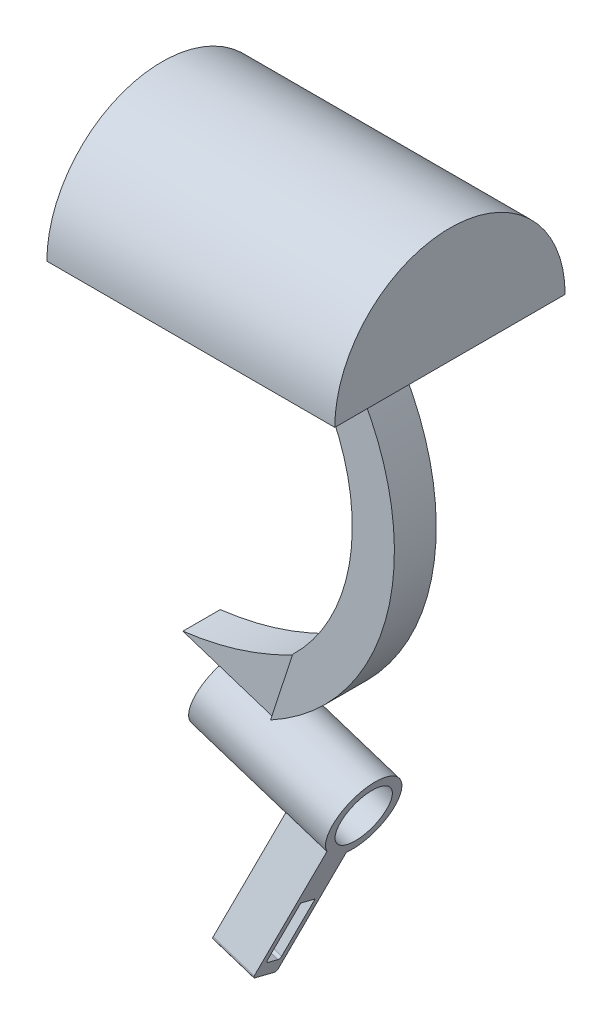
ISO-10303-21;
HEADER;
FILE_DESCRIPTION(('STEP AP214'),'2;1');
FILE_NAME('part.step','',(''),(''),'','','');
FILE_SCHEMA(('AUTOMOTIVE_DESIGN { 1 0 10303 214 1 1 1 1 }'));
ENDSEC;
DATA;
#1=APPLICATION_CONTEXT('core data for automotive mechanical design processes');
#2=APPLICATION_PROTOCOL_DEFINITION('international standard','automotive_design',2000,#1);
#3=PRODUCT_CONTEXT('',#1,'mechanical');
#4=PRODUCT('Part','Part','',(#3));
#5=PRODUCT_RELATED_PRODUCT_CATEGORY('part','',(#4));
#6=PRODUCT_DEFINITION_FORMATION('','',#4);
#7=PRODUCT_DEFINITION_CONTEXT('part definition',#1,'design');
#8=PRODUCT_DEFINITION('design','',#6,#7);
#9=PRODUCT_DEFINITION_SHAPE('','',#8);
#10=(LENGTH_UNIT() NAMED_UNIT(*) SI_UNIT(.MILLI.,.METRE.));
#11=(NAMED_UNIT(*) PLANE_ANGLE_UNIT() SI_UNIT($,.RADIAN.));
#12=(NAMED_UNIT(*) SI_UNIT($,.STERADIAN.) SOLID_ANGLE_UNIT());
#13=UNCERTAINTY_MEASURE_WITH_UNIT(LENGTH_MEASURE(1.E-05),#10,'distance_accuracy_value','');
#14=(GEOMETRIC_REPRESENTATION_CONTEXT(3) GLOBAL_UNCERTAINTY_ASSIGNED_CONTEXT((#13)) GLOBAL_UNIT_ASSIGNED_CONTEXT((#10,
#11,#12)) REPRESENTATION_CONTEXT('',''));
#15=CARTESIAN_POINT('',(0.,0.,0.));
#16=DIRECTION('',(0.,0.,1.));
#17=DIRECTION('',(1.,0.,0.));
#18=AXIS2_PLACEMENT_3D('',#15,#16,#17);
#19=CARTESIAN_POINT('',(17.8017554635536,-38.5301291914229,-0.361104816462897));
#20=DIRECTION('',(-0.951246009926474,0.308433183362237,0.));
#21=DIRECTION('',(-0.308433183362237,-0.951246009926474,0.));
#22=AXIS2_PLACEMENT_3D('',#19,#20,#21);
#23=CYLINDRICAL_SURFACE('',#22,3.22000000000001);
#24=DIRECTION('',(-0.951246009926474,0.308433183362237,0.));
#25=VECTOR('',#24,1.);
#26=CARTESIAN_POINT('',(18.7173676487321,-35.7062681908114,-1.60844734182558));
#27=LINE('',#26,#25);
#28=CARTESIAN_POINT('',(11.4688730530924,-33.3560073335911,-1.60844734182558));
#29=VERTEX_POINT('',#28);
#30=CARTESIAN_POINT('',(6.63654332266588,-31.7891667621109,-1.60844734182558));
#31=VERTEX_POINT('',#30);
#32=EDGE_CURVE('E339',#29,#31,#27,.T.);
#33=ORIENTED_EDGE('',*,*,#32,.F.);
#34=CARTESIAN_POINT('',(10.5532608679139,-36.1798683342026,-0.361104816462897));
#35=DIRECTION('',(0.951246009926474,-0.308433183362237,0.));
#36=DIRECTION('',(0.308433183362237,0.951246009926474,0.));
#37=AXIS2_PLACEMENT_3D('',#34,#35,#36);
#38=CIRCLE('',#37,3.22000000000001);
#39=CARTESIAN_POINT('',(11.4225779785249,-33.4987870581379,-1.91818251276916));
#40=VERTEX_POINT('',#39);
#41=EDGE_CURVE('E336',#40,#29,#38,.T.);
#42=ORIENTED_EDGE('',*,*,#41,.F.);
#43=CARTESIAN_POINT('',(11.4225779785249,-33.4987870581379,1.19597287984337));
#44=CARTESIAN_POINT('',(11.4610881963903,-33.4778805321114,1.13848649285918));
#45=CARTESIAN_POINT('',(11.4976974271193,-33.457848595571,1.07938677636928));
#46=CARTESIAN_POINT('',(11.5667879864595,-33.4198030430014,0.958147248746149));
#47=CARTESIAN_POINT('',(11.5992665209433,-33.4017907941144,0.896005418774431));
#48=CARTESIAN_POINT('',(11.6598364071952,-33.3680160660679,0.768695207691123));
#49=CARTESIAN_POINT('',(11.6879099190608,-33.3522627564843,0.703515839204143));
#50=CARTESIAN_POINT('',(11.7391724176084,-33.3233666913531,0.570739597193408));
#51=CARTESIAN_POINT('',(11.7623624604645,-33.3102233713641,0.503143250109748));
#52=CARTESIAN_POINT('',(11.8243143230406,-33.2749918398734,0.29669962430612));
#53=CARTESIAN_POINT('',(11.8552549856085,-33.2572162665025,0.154619691802103));
#54=CARTESIAN_POINT('',(11.8943387194357,-33.2347267107852,-0.133235193575715));
#55=CARTESIAN_POINT('',(11.9025434014921,-33.2299774296705,-0.27899907833514));
#56=CARTESIAN_POINT('',(11.8960755868006,-33.2337098386662,-0.56115616866191));
#57=CARTESIAN_POINT('',(11.8827333700932,-33.2414221784818,-0.697591567284176));
#58=CARTESIAN_POINT('',(11.8363086598536,-33.2680845692179,-0.966191620227638));
#59=CARTESIAN_POINT('',(11.8031828968441,-33.2870592519493,-1.09834624196263));
#60=CARTESIAN_POINT('',(11.7200929138676,-33.3341799560083,-1.3508225921895));
#61=CARTESIAN_POINT('',(11.6706816916587,-33.36202388483,-1.47138397996124));
#62=CARTESIAN_POINT('',(11.5854696404533,-33.4094434209905,-1.64478194033506));
#63=CARTESIAN_POINT('',(11.5552716325635,-33.42616201534,-1.70125897601453));
#64=CARTESIAN_POINT('',(11.4914398477229,-33.4612714180094,-1.81165820209945));
#65=CARTESIAN_POINT('',(11.4578077810446,-33.4796613934306,-1.86558164487798));
#66=CARTESIAN_POINT('',(11.4225779785249,-33.4987870581379,-1.91818251276916));
#67=B_SPLINE_CURVE_WITH_KNOTS('',3,(#43,#44,#45,#46,#47,#48,#49,#50,#51,#52,#53,#54,#55,#56,#57,
#58,#59,#60,#61,#62,#63,#64,#65,#66),.UNSPECIFIED.,.F.,.F.,(4,2,2,2,2,2,2,2,2,2,2,4),(0.,
0.216825002257189,0.433795900112481,0.651624009827815,0.869404960189353,1.30639403890528,
1.74219778510535,2.15210832820271,2.56291870518645,2.96101197243392,3.15944596650321,
3.35778161163335),.UNSPECIFIED.);
#68=CARTESIAN_POINT('',(11.4225779785249,-33.4987870581379,1.19597287984337));
#69=VERTEX_POINT('',#68);
#70=EDGE_CURVE('E327',#69,#40,#67,.T.);
#71=ORIENTED_EDGE('',*,*,#70,.F.);
#72=CARTESIAN_POINT('',(11.4688730530924,-33.3560073335911,0.88623770889979));
#73=VERTEX_POINT('',#72);
#74=EDGE_CURVE('E337',#73,#69,#38,.T.);
#75=ORIENTED_EDGE('',*,*,#74,.F.);
#76=DIRECTION('',(-0.951246009926474,0.308433183362237,0.));
#77=VECTOR('',#76,1.);
#78=CARTESIAN_POINT('',(18.7173676487321,-35.7062681908114,0.88623770889979));
#79=LINE('',#78,#77);
#80=CARTESIAN_POINT('',(6.63654332266588,-31.7891667621109,0.88623770889979));
#81=VERTEX_POINT('',#80);
#82=EDGE_CURVE('E408',#81,#73,#79,.F.);
#83=ORIENTED_EDGE('',*,*,#82,.F.);
#84=CARTESIAN_POINT('',(5.72093113748741,-34.6130277627224,-0.361104816462897));
#85=DIRECTION('',(-0.951246009926474,0.308433183362237,0.));
#86=DIRECTION('',(-0.308433183362237,-0.951246009926474,0.));
#87=AXIS2_PLACEMENT_3D('',#84,#85,#86);
#88=CIRCLE('',#87,3.22000000000001);
#89=EDGE_CURVE('E409',#31,#81,#88,.T.);
#90=ORIENTED_EDGE('',*,*,#89,.F.);
#91=EDGE_LOOP('',(#33,#42,#71,#75,#83,#90));
#92=FACE_BOUND('',#91,.T.);
#93=CARTESIAN_POINT('',(14.1775081657338,-37.3549987628127,-0.361104816462897));
#94=DIRECTION('',(0.951246009926474,-0.308433183362237,0.));
#95=DIRECTION('',(0.308433183362237,0.951246009926474,0.));
#96=AXIS2_PLACEMENT_3D('',#93,#94,#95);
#97=CIRCLE('',#96,3.22000000000001);
#98=CARTESIAN_POINT('',(13.1989686901407,-40.3729352946945,0.189276491576747));
#99=VERTEX_POINT('',#98);
#100=CARTESIAN_POINT('',(13.637767136371,-39.0196267220291,2.34187379584936));
#101=VERTEX_POINT('',#100);
#102=EDGE_CURVE('E11',#99,#101,#97,.F.);
#103=ORIENTED_EDGE('',*,*,#102,.T.);
#104=DIRECTION('',(0.951246009926474,-0.308433183362237,0.));
#105=VECTOR('',#104,1.);
#106=CARTESIAN_POINT('',(13.637767136371,-39.0196267220291,2.34187379584935));
#107=LINE('',#106,#105);
#108=CARTESIAN_POINT('',(17.2620144341909,-40.1947571506393,2.34187379584935));
#109=VERTEX_POINT('',#108);
#110=EDGE_CURVE('E222',#101,#109,#107,.T.);
#111=ORIENTED_EDGE('',*,*,#110,.T.);
#112=CARTESIAN_POINT('',(17.8017554635536,-38.5301291914229,-0.361104816462897));
#113=DIRECTION('',(-0.951246009926474,0.308433183362237,0.));
#114=DIRECTION('',(-0.308433183362237,-0.951246009926474,0.));
#115=AXIS2_PLACEMENT_3D('',#112,#113,#114);
#116=CIRCLE('',#115,3.22000000000001);
#117=CARTESIAN_POINT('',(16.8232159879605,-41.5480657233046,0.189276491576746));
#118=VERTEX_POINT('',#117);
#119=EDGE_CURVE('E406',#109,#118,#116,.T.);
#120=ORIENTED_EDGE('',*,*,#119,.T.);
#121=DIRECTION('',(0.951246009926474,-0.308433183362237,0.));
#122=VECTOR('',#121,1.);
#123=CARTESIAN_POINT('',(13.1989686901407,-40.3729352946945,0.189276491576747));
#124=LINE('',#123,#122);
#125=EDGE_CURVE('E58',#99,#118,#124,.T.);
#126=ORIENTED_EDGE('',*,*,#125,.F.);
#127=EDGE_LOOP('',(#103,#111,#120,#126));
#128=FACE_BOUND('',#127,.T.);
#129=ADVANCED_FACE('F40',(#92,#128),#23,.T.);
#130=CARTESIAN_POINT('',(8.4794198870601,-26.1055079561511,-2.00859754063387));
#131=DIRECTION('',(0.,0.,1.));
#132=DIRECTION('',(1.,0.,0.));
#133=AXIS2_PLACEMENT_3D('',#130,#131,#132);
#134=PLANE('',#133);
#135=CARTESIAN_POINT('',(3.49552899788866,-30.7707203906488,-2.00859754063387));
#136=CARTESIAN_POINT('',(8.6836530969002,-30.1293735054419,-2.00859754063387));
#137=CARTESIAN_POINT('',(13.3117496174866,-27.6723485276312,-2.00859754063387));
#138=B_SPLINE_CURVE_WITH_KNOTS('',2,(#135,#136,#137),.UNSPECIFIED.,.F.,.F.,(3,3),(0.,1.),.UNSPECIFIED.);
#139=CARTESIAN_POINT('',(13.3117496174866,-27.6723485276312,-2.00859754063387));
#140=VERTEX_POINT('',#139);
#141=CARTESIAN_POINT('',(3.49552899788866,-30.7707203906488,-2.00859754063387));
#142=VERTEX_POINT('',#141);
#143=EDGE_CURVE('E750',#140,#142,#138,.F.);
#144=ORIENTED_EDGE('',*,*,#143,.F.);
#145=DIRECTION('',(-0.308433183362237,-0.951246009926474,0.));
#146=VECTOR('',#145,1.);
#147=CARTESIAN_POINT('',(13.3117496174866,-27.6723485276312,-2.00859754063387));
#148=LINE('',#147,#146);
#149=CARTESIAN_POINT('',(11.4688730530924,-33.3560073335911,-2.00859754063387));
#150=VERTEX_POINT('',#149);
#151=EDGE_CURVE('E418',#140,#150,#148,.T.);
#152=ORIENTED_EDGE('',*,*,#151,.T.);
#153=DIRECTION('',(0.951246009926474,-0.308433183362237,0.));
#154=VECTOR('',#153,1.);
#155=CARTESIAN_POINT('',(6.63654332266587,-31.7891667621109,-2.00859754063387));
#156=LINE('',#155,#154);
#157=EDGE_CURVE('E436',#142,#150,#156,.T.);
#158=ORIENTED_EDGE('',*,*,#157,.F.);
#159=EDGE_LOOP('',(#144,#152,#158));
#160=FACE_BOUND('',#159,.T.);
#161=ADVANCED_FACE('F322',(#160),#134,.F.);
#162=CARTESIAN_POINT('',(8.4794198870601,-26.1055079561511,1.28638790770808));
#163=DIRECTION('',(0.,0.,-1.));
#164=DIRECTION('',(-1.,0.,0.));
#165=AXIS2_PLACEMENT_3D('',#162,#163,#164);
#166=PLANE('',#165);
#167=CARTESIAN_POINT('',(3.49552899788866,-30.7707203906488,1.28638790770808));
#168=CARTESIAN_POINT('',(8.6836530969002,-30.1293735054419,1.28638790770808));
#169=CARTESIAN_POINT('',(13.3117496174866,-27.6723485276312,1.28638790770808));
#170=B_SPLINE_CURVE_WITH_KNOTS('',2,(#167,#168,#169),.UNSPECIFIED.,.F.,.F.,(3,3),(0.,1.),.UNSPECIFIED.);
#171=CARTESIAN_POINT('',(3.49552899788866,-30.7707203906488,1.28638790770808));
#172=VERTEX_POINT('',#171);
#173=CARTESIAN_POINT('',(13.3117496174866,-27.6723485276312,1.28638790770808));
#174=VERTEX_POINT('',#173);
#175=EDGE_CURVE('E273',#172,#174,#170,.T.);
#176=ORIENTED_EDGE('',*,*,#175,.F.);
#177=DIRECTION('',(0.951246009926474,-0.308433183362237,0.));
#178=VECTOR('',#177,1.);
#179=CARTESIAN_POINT('',(6.63654332266587,-31.7891667621109,1.28638790770808));
#180=LINE('',#179,#178);
#181=CARTESIAN_POINT('',(11.4688730530924,-33.3560073335911,1.28638790770808));
#182=VERTEX_POINT('',#181);
#183=EDGE_CURVE('E433',#172,#182,#180,.T.);
#184=ORIENTED_EDGE('',*,*,#183,.T.);
#185=DIRECTION('',(0.308433183362237,0.951246009926474,0.));
#186=VECTOR('',#185,1.);
#187=CARTESIAN_POINT('',(13.3117496174866,-27.6723485276312,1.28638790770808));
#188=LINE('',#187,#186);
#189=EDGE_CURVE('E428',#182,#174,#188,.T.);
#190=ORIENTED_EDGE('',*,*,#189,.T.);
#191=EDGE_LOOP('',(#176,#184,#190));
#192=FACE_BOUND('',#191,.T.);
#193=ADVANCED_FACE('F478',(#192),#166,.F.);
#194=CARTESIAN_POINT('',(15.3320112562343,-4.97127030206573,0.));
#195=DIRECTION('',(0.951246009926474,-0.308433183362237,0.));
#196=DIRECTION('',(0.308433183362237,0.951246009926474,0.));
#197=AXIS2_PLACEMENT_3D('',#194,#195,#196);
#198=PLANE('',#197);
#199=CARTESIAN_POINT('',(5.72093113748741,-34.6130277627225,-0.361104816462897));
#200=DIRECTION('',(0.951246009926474,-0.308433183362237,0.));
#201=DIRECTION('',(0.308433183362237,0.951246009926474,0.));
#202=AXIS2_PLACEMENT_3D('',#199,#200,#201);
#203=CIRCLE('',#202,2.42090734850771);
#204=CARTESIAN_POINT('',(6.46761929761267,-32.3101493070528,-0.361104816462897));
#205=VERTEX_POINT('',#204);
#206=EDGE_CURVE('E229',#205,#205,#203,.T.);
#207=ORIENTED_EDGE('',*,*,#206,.T.);
#208=EDGE_LOOP('',(#207));
#209=FACE_BOUND('',#208,.T.);
#210=DIRECTION('',(0.,0.,1.));
#211=VECTOR('',#210,1.);
#212=CARTESIAN_POINT('',(6.63654332266588,-31.789166762111,1.28638790770808));
#213=LINE('',#212,#211);
#214=EDGE_CURVE('E48',#31,#81,#213,.T.);
#215=ORIENTED_EDGE('',*,*,#214,.F.);
#216=ORIENTED_EDGE('',*,*,#89,.T.);
#217=EDGE_LOOP('',(#215,#216));
#218=FACE_BOUND('',#217,.T.);
#219=ADVANCED_FACE('F324',(#209,#218),#198,.F.);
#220=CARTESIAN_POINT('',(16.3097017874055,-18.4262939737782,0.));
#221=DIRECTION('',(0.951246009926474,-0.308433183362237,0.));
#222=DIRECTION('',(0.,0.,1.));
#223=AXIS2_PLACEMENT_3D('',#220,#221,#222);
#224=PLANE('',#223);
#225=ORIENTED_EDGE('',*,*,#151,.F.);
#226=DIRECTION('',(0.,0.,-1.));
#227=VECTOR('',#226,1.);
#228=CARTESIAN_POINT('',(13.3117496174866,-27.6723485276312,1.28638790770808));
#229=LINE('',#228,#227);
#230=EDGE_CURVE('E431',#174,#140,#229,.T.);
#231=ORIENTED_EDGE('',*,*,#230,.F.);
#232=ORIENTED_EDGE('',*,*,#189,.F.);
#233=DIRECTION('',(0.,0.,1.));
#234=VECTOR('',#233,1.);
#235=CARTESIAN_POINT('',(11.4688730530924,-33.3560073335911,1.28638790770808));
#236=LINE('',#235,#234);
#237=EDGE_CURVE('E420',#73,#182,#236,.T.);
#238=ORIENTED_EDGE('',*,*,#237,.F.);
#239=ORIENTED_EDGE('',*,*,#74,.T.);
#240=DIRECTION('',(0.,0.,-1.));
#241=VECTOR('',#240,1.);
#242=CARTESIAN_POINT('',(11.4225779785249,-33.4987870581379,-2.21601123595506));
#243=LINE('',#242,#241);
#244=CARTESIAN_POINT('',(11.4225779785249,-33.4987870581379,1.47398876404494));
#245=VERTEX_POINT('',#244);
#246=EDGE_CURVE('E460',#245,#69,#243,.T.);
#247=ORIENTED_EDGE('',*,*,#246,.F.);
#248=DIRECTION('',(-0.308433183362237,-0.951246009926473,0.));
#249=VECTOR('',#248,1.);
#250=CARTESIAN_POINT('',(13.3626227388853,-27.5154495415509,1.47398876404494));
#251=LINE('',#250,#249);
#252=CARTESIAN_POINT('',(13.3626227388853,-27.5154495415509,1.47398876404494));
#253=VERTEX_POINT('',#252);
#254=EDGE_CURVE('E448',#253,#245,#251,.T.);
#255=ORIENTED_EDGE('',*,*,#254,.F.);
#256=DIRECTION('',(0.,0.,1.));
#257=VECTOR('',#256,1.);
#258=CARTESIAN_POINT('',(13.3626227388853,-27.5154495415509,-2.21601123595506));
#259=LINE('',#258,#257);
#260=CARTESIAN_POINT('',(13.3626227388853,-27.5154495415509,-2.21601123595506));
#261=VERTEX_POINT('',#260);
#262=EDGE_CURVE('E442',#261,#253,#259,.T.);
#263=ORIENTED_EDGE('',*,*,#262,.F.);
#264=DIRECTION('',(0.308433183362237,0.951246009926473,0.));
#265=VECTOR('',#264,1.);
#266=CARTESIAN_POINT('',(13.3626227388853,-27.5154495415509,-2.21601123595506));
#267=LINE('',#266,#265);
#268=CARTESIAN_POINT('',(11.4225779785249,-33.4987870581379,-2.21601123595506));
#269=VERTEX_POINT('',#268);
#270=EDGE_CURVE('E391',#269,#261,#267,.T.);
#271=ORIENTED_EDGE('',*,*,#270,.F.);
#272=EDGE_CURVE('E458',#40,#269,#243,.T.);
#273=ORIENTED_EDGE('',*,*,#272,.F.);
#274=ORIENTED_EDGE('',*,*,#41,.T.);
#275=EDGE_CURVE('E425',#150,#29,#236,.T.);
#276=ORIENTED_EDGE('',*,*,#275,.F.);
#277=EDGE_LOOP('',(#225,#231,#232,#238,#239,#247,#255,#263,#271,#273,#274,#276));
#278=FACE_BOUND('',#277,.T.);
#279=ADVANCED_FACE('F354',(#278),#224,.F.);
#280=CARTESIAN_POINT('',(0.,0.,-0.742022471910108));
#281=DIRECTION('',(0.,1.,0.));
#282=DIRECTION('',(0.,0.,1.));
#283=AXIS2_PLACEMENT_3D('',#280,#281,#282);
#284=PLANE('',#283);
#285=DIRECTION('',(0.,0.,-1.));
#286=VECTOR('',#285,1.);
#287=CARTESIAN_POINT('',(0.,0.,-0.371011235955054));
#288=LINE('',#287,#286);
#289=CARTESIAN_POINT('',(0.,0.,9.78898876404495));
#290=VERTEX_POINT('',#289);
#291=CARTESIAN_POINT('',(0.,0.,-10.5310112359551));
#292=VERTEX_POINT('',#291);
#293=EDGE_CURVE('E382',#290,#292,#288,.T.);
#294=ORIENTED_EDGE('',*,*,#293,.T.);
#295=DIRECTION('',(-1.,0.,0.));
#296=VECTOR('',#295,1.);
#297=CARTESIAN_POINT('',(0.,0.,-10.5310112359551));
#298=LINE('',#297,#296);
#299=CARTESIAN_POINT('',(25.4,0.,-10.5310112359551));
#300=VERTEX_POINT('',#299);
#301=EDGE_CURVE('E385',#300,#292,#298,.T.);
#302=ORIENTED_EDGE('',*,*,#301,.F.);
#303=DIRECTION('',(0.,0.,1.));
#304=VECTOR('',#303,1.);
#305=CARTESIAN_POINT('',(25.4,0.,-0.371011235955054));
#306=LINE('',#305,#304);
#307=CARTESIAN_POINT('',(25.4,0.,9.78898876404495));
#308=VERTEX_POINT('',#307);
#309=EDGE_CURVE('E375',#300,#308,#306,.T.);
#310=ORIENTED_EDGE('',*,*,#309,.T.);
#311=DIRECTION('',(-1.,0.,0.));
#312=VECTOR('',#311,1.);
#313=CARTESIAN_POINT('',(0.,0.,9.78898876404495));
#314=LINE('',#313,#312);
#315=EDGE_CURVE('E381',#308,#290,#314,.T.);
#316=ORIENTED_EDGE('',*,*,#315,.T.);
#317=EDGE_LOOP('',(#294,#302,#310,#316));
#318=FACE_BOUND('',#317,.T.);
#319=DIRECTION('',(0.,0.,1.));
#320=VECTOR('',#319,1.);
#321=CARTESIAN_POINT('',(9.55499994,0.,-2.21601123595506));
#322=LINE('',#321,#320);
#323=CARTESIAN_POINT('',(9.55499994,0.,-2.21601123595506));
#324=VERTEX_POINT('',#323);
#325=CARTESIAN_POINT('',(9.55499994,0.,1.47398876404494));
#326=VERTEX_POINT('',#325);
#327=EDGE_CURVE('E439',#324,#326,#322,.T.);
#328=ORIENTED_EDGE('',*,*,#327,.T.);
#329=DIRECTION('',(1.,0.,0.));
#330=VECTOR('',#329,1.);
#331=CARTESIAN_POINT('',(9.55499994,0.,1.47398876404494));
#332=LINE('',#331,#330);
#333=CARTESIAN_POINT('',(15.84500006,0.,1.47398876404494));
#334=VERTEX_POINT('',#333);
#335=EDGE_CURVE('E441',#326,#334,#332,.T.);
#336=ORIENTED_EDGE('',*,*,#335,.T.);
#337=DIRECTION('',(0.,0.,-1.));
#338=VECTOR('',#337,1.);
#339=CARTESIAN_POINT('',(15.84500006,0.,-2.21601123595506));
#340=LINE('',#339,#338);
#341=CARTESIAN_POINT('',(15.84500006,0.,-2.21601123595506));
#342=VERTEX_POINT('',#341);
#343=EDGE_CURVE('E453',#334,#342,#340,.T.);
#344=ORIENTED_EDGE('',*,*,#343,.T.);
#345=DIRECTION('',(-1.,0.,0.));
#346=VECTOR('',#345,1.);
#347=CARTESIAN_POINT('',(9.55499994,0.,-2.21601123595506));
#348=LINE('',#347,#346);
#349=EDGE_CURVE('E451',#342,#324,#348,.T.);
#350=ORIENTED_EDGE('',*,*,#349,.T.);
#351=EDGE_LOOP('',(#328,#336,#344,#350));
#352=FACE_BOUND('',#351,.T.);
#353=ADVANCED_FACE('F357',(#318,#352),#284,.F.);
#354=CARTESIAN_POINT('',(0.,0.,-0.371011235955054));
#355=DIRECTION('',(1.,0.,0.));
#356=DIRECTION('',(0.,0.,-1.));
#357=AXIS2_PLACEMENT_3D('',#354,#355,#356);
#358=PLANE('',#357);
#359=CARTESIAN_POINT('',(0.,0.,-0.371011235955054));
#360=DIRECTION('',(-1.,0.,0.));
#361=DIRECTION('',(0.,0.,1.));
#362=AXIS2_PLACEMENT_3D('',#359,#360,#361);
#363=CIRCLE('',#362,10.16);
#364=EDGE_CURVE('E386',#290,#292,#363,.T.);
#365=ORIENTED_EDGE('',*,*,#364,.T.);
#366=ORIENTED_EDGE('',*,*,#293,.F.);
#367=EDGE_LOOP('',(#365,#366));
#368=FACE_BOUND('',#367,.T.);
#369=ADVANCED_FACE('F361',(#368),#358,.F.);
#370=CARTESIAN_POINT('',(0.,0.,-0.371011235955054));
#371=DIRECTION('',(-1.,0.,0.));
#372=DIRECTION('',(0.,0.,1.));
#373=AXIS2_PLACEMENT_3D('',#370,#371,#372);
#374=CYLINDRICAL_SURFACE('',#373,10.16);
#375=CARTESIAN_POINT('',(25.4,0.,-0.371011235955054));
#376=DIRECTION('',(-1.,0.,0.));
#377=DIRECTION('',(0.,0.,1.));
#378=AXIS2_PLACEMENT_3D('',#375,#376,#377);
#379=CIRCLE('',#378,10.16);
#380=EDGE_CURVE('E377',#308,#300,#379,.T.);
#381=ORIENTED_EDGE('',*,*,#380,.T.);
#382=ORIENTED_EDGE('',*,*,#301,.T.);
#383=ORIENTED_EDGE('',*,*,#364,.F.);
#384=ORIENTED_EDGE('',*,*,#315,.F.);
#385=EDGE_LOOP('',(#381,#382,#383,#384));
#386=FACE_BOUND('',#385,.T.);
#387=ADVANCED_FACE('F42',(#386),#374,.T.);
#388=CARTESIAN_POINT('',(25.4,0.,-0.371011235955054));
#389=DIRECTION('',(-1.,0.,0.));
#390=DIRECTION('',(0.,0.,1.));
#391=AXIS2_PLACEMENT_3D('',#388,#389,#390);
#392=PLANE('',#391);
#393=ORIENTED_EDGE('',*,*,#309,.F.);
#394=ORIENTED_EDGE('',*,*,#380,.F.);
#395=EDGE_LOOP('',(#393,#394));
#396=FACE_BOUND('',#395,.T.);
#397=ADVANCED_FACE('F353',(#396),#392,.F.);
#398=CARTESIAN_POINT('',(1.45678681096229,-15.1418176082245,0.));
#399=DIRECTION('',(0.,0.,-1.));
#400=DIRECTION('',(-1.,0.,0.));
#401=AXIS2_PLACEMENT_3D('',#398,#399,#400);
#402=CYLINDRICAL_SURFACE('',#401,17.1713626822118);
#403=CARTESIAN_POINT('',(1.45678681096229,-15.1418176082245,1.47398876404494));
#404=DIRECTION('',(0.,0.,-1.));
#405=DIRECTION('',(0.471611559251894,0.881806405726335,0.));
#406=AXIS2_PLACEMENT_3D('',#403,#404,#405);
#407=CIRCLE('',#406,17.1713626822118);
#408=EDGE_CURVE('E444',#326,#253,#407,.T.);
#409=ORIENTED_EDGE('',*,*,#408,.F.);
#410=ORIENTED_EDGE('',*,*,#327,.F.);
#411=CARTESIAN_POINT('',(1.45678681096229,-15.1418176082245,-2.21601123595506));
#412=DIRECTION('',(0.,0.,-1.));
#413=DIRECTION('',(0.471611559251894,0.881806405726335,0.));
#414=AXIS2_PLACEMENT_3D('',#411,#412,#413);
#415=CIRCLE('',#414,17.1713626822118);
#416=EDGE_CURVE('E445',#324,#261,#415,.T.);
#417=ORIENTED_EDGE('',*,*,#416,.T.);
#418=ORIENTED_EDGE('',*,*,#262,.T.);
#419=EDGE_LOOP('',(#409,#410,#417,#418));
#420=FACE_BOUND('',#419,.T.);
#421=ADVANCED_FACE('F366',(#420),#402,.F.);
#422=CARTESIAN_POINT('',(9.55499994,0.,1.47398876404494));
#423=DIRECTION('',(0.,0.,-1.));
#424=DIRECTION('',(-1.,0.,0.));
#425=AXIS2_PLACEMENT_3D('',#422,#423,#424);
#426=PLANE('',#425);
#427=CARTESIAN_POINT('',(1.45678681096229,-15.1418176082245,1.47398876404494));
#428=DIRECTION('',(0.,0.,-1.));
#429=DIRECTION('',(0.688837192778454,0.724916079174065,0.));
#430=AXIS2_PLACEMENT_3D('',#427,#428,#429);
#431=CIRCLE('',#430,20.8876834756878);
#432=EDGE_CURVE('E455',#334,#245,#431,.T.);
#433=ORIENTED_EDGE('',*,*,#432,.F.);
#434=ORIENTED_EDGE('',*,*,#335,.F.);
#435=ORIENTED_EDGE('',*,*,#408,.T.);
#436=ORIENTED_EDGE('',*,*,#254,.T.);
#437=EDGE_LOOP('',(#433,#434,#435,#436));
#438=FACE_BOUND('',#437,.T.);
#439=ADVANCED_FACE('F347',(#438),#426,.F.);
#440=CARTESIAN_POINT('',(1.45678681096229,-15.1418176082245,0.));
#441=DIRECTION('',(0.,0.,-1.));
#442=DIRECTION('',(-1.,0.,0.));
#443=AXIS2_PLACEMENT_3D('',#440,#441,#442);
#444=CYLINDRICAL_SURFACE('',#443,20.8876834756878);
#445=ORIENTED_EDGE('',*,*,#246,.T.);
#446=ORIENTED_EDGE('',*,*,#70,.T.);
#447=ORIENTED_EDGE('',*,*,#272,.T.);
#448=CARTESIAN_POINT('',(1.45678681096229,-15.1418176082245,-2.21601123595506));
#449=DIRECTION('',(0.,0.,-1.));
#450=DIRECTION('',(0.688837192778454,0.724916079174065,0.));
#451=AXIS2_PLACEMENT_3D('',#448,#449,#450);
#452=CIRCLE('',#451,20.8876834756878);
#453=EDGE_CURVE('E394',#342,#269,#452,.T.);
#454=ORIENTED_EDGE('',*,*,#453,.F.);
#455=ORIENTED_EDGE('',*,*,#343,.F.);
#456=ORIENTED_EDGE('',*,*,#432,.T.);
#457=EDGE_LOOP('',(#445,#446,#447,#454,#455,#456));
#458=FACE_BOUND('',#457,.T.);
#459=ADVANCED_FACE('F341',(#458),#444,.T.);
#460=CARTESIAN_POINT('',(9.55499994,0.,-2.21601123595506));
#461=DIRECTION('',(0.,0.,1.));
#462=DIRECTION('',(1.,0.,0.));
#463=AXIS2_PLACEMENT_3D('',#460,#461,#462);
#464=PLANE('',#463);
#465=ORIENTED_EDGE('',*,*,#270,.T.);
#466=ORIENTED_EDGE('',*,*,#416,.F.);
#467=ORIENTED_EDGE('',*,*,#349,.F.);
#468=ORIENTED_EDGE('',*,*,#453,.T.);
#469=EDGE_LOOP('',(#465,#466,#467,#468));
#470=FACE_BOUND('',#469,.T.);
#471=ADVANCED_FACE('F346',(#470),#464,.F.);
#472=CARTESIAN_POINT('',(6.63654332266587,-31.7891667621109,1.28638790770808));
#473=DIRECTION('',(0.308433183362237,0.951246009926474,0.));
#474=DIRECTION('',(-0.951246009926474,0.308433183362237,0.));
#475=AXIS2_PLACEMENT_3D('',#472,#473,#474);
#476=PLANE('',#475);
#477=ORIENTED_EDGE('',*,*,#183,.F.);
#478=DIRECTION('',(0.,0.,1.));
#479=VECTOR('',#478,1.);
#480=CARTESIAN_POINT('',(3.49552899788866,-30.7707203906488,1.28638790770808));
#481=LINE('',#480,#479);
#482=EDGE_CURVE('E405',#142,#172,#481,.T.);
#483=ORIENTED_EDGE('',*,*,#482,.F.);
#484=ORIENTED_EDGE('',*,*,#157,.T.);
#485=ORIENTED_EDGE('',*,*,#275,.T.);
#486=ORIENTED_EDGE('',*,*,#32,.T.);
#487=ORIENTED_EDGE('',*,*,#214,.T.);
#488=ORIENTED_EDGE('',*,*,#82,.T.);
#489=ORIENTED_EDGE('',*,*,#237,.T.);
#490=EDGE_LOOP('',(#477,#483,#484,#485,#486,#487,#488,#489));
#491=FACE_BOUND('',#490,.T.);
#492=ADVANCED_FACE('F317',(#491),#476,.F.);
#493=CARTESIAN_POINT('',(17.8017554635536,-38.5301291914229,-0.361104816462897));
#494=DIRECTION('',(-0.951246009926474,0.308433183362237,0.));
#495=DIRECTION('',(-0.308433183362237,-0.951246009926474,0.));
#496=AXIS2_PLACEMENT_3D('',#493,#494,#495);
#497=PLANE('',#496);
#498=CARTESIAN_POINT('',(17.8017554635536,-38.5301291914229,-0.361104816462897));
#499=DIRECTION('',(0.951246009926474,-0.308433183362237,0.));
#500=DIRECTION('',(0.308433183362237,0.951246009926474,0.));
#501=AXIS2_PLACEMENT_3D('',#498,#499,#500);
#502=CIRCLE('',#501,2.42090734850771);
#503=CARTESIAN_POINT('',(18.5484436236789,-36.2272507357532,-0.361104816462897));
#504=VERTEX_POINT('',#503);
#505=EDGE_CURVE('E487',#504,#504,#502,.T.);
#506=ORIENTED_EDGE('',*,*,#505,.F.);
#507=EDGE_LOOP('',(#506));
#508=FACE_BOUND('',#507,.T.);
#509=ORIENTED_EDGE('',*,*,#119,.F.);
#510=DIRECTION('',(0.291393137165049,0.898692404061696,-0.327783468916478));
#511=VECTOR('',#510,1.);
#512=CARTESIAN_POINT('',(26.5458924214069,-11.5621314528666,-8.10141172986063));
#513=LINE('',#512,#511);
#514=CARTESIAN_POINT('',(14.2442950717244,-49.5017761663355,5.73645793214423));
#515=VERTEX_POINT('',#514);
#516=EDGE_CURVE('E250',#515,#109,#513,.T.);
#517=ORIENTED_EDGE('',*,*,#516,.F.);
#518=CARTESIAN_POINT('',(14.2211837720253,-49.573054267425,5.52048742459439));
#519=DIRECTION('',(0.951246009926474,-0.308433183362237,0.));
#520=DIRECTION('',(0.308433183362237,0.951246009926474,0.));
#521=AXIS2_PLACEMENT_3D('',#518,#519,#520);
#522=CIRCLE('',#521,0.228600000000046);
#523=CARTESIAN_POINT('',(14.1545713008694,-49.7784953509935,5.59541872558878));
#524=VERTEX_POINT('',#523);
#525=EDGE_CURVE('E214',#524,#515,#522,.F.);
#526=ORIENTED_EDGE('',*,*,#525,.F.);
#527=DIRECTION('',(0.101099298771425,0.311802716926654,0.944752876420645));
#528=VECTOR('',#527,1.);
#529=CARTESIAN_POINT('',(15.0446257614622,-47.0334575278037,13.912800962999));
#530=LINE('',#529,#528);
#531=CARTESIAN_POINT('',(13.9480456533391,-50.4154459411312,3.66547754963669));
#532=VERTEX_POINT('',#531);
#533=EDGE_CURVE('E253',#532,#524,#530,.T.);
#534=ORIENTED_EDGE('',*,*,#533,.F.);
#535=CARTESIAN_POINT('',(14.014658124495,-50.2100048575627,3.59054624864238));
#536=DIRECTION('',(0.951246009926474,-0.308433183362237,0.));
#537=DIRECTION('',(0.308433183362237,0.951246009926474,0.));
#538=AXIS2_PLACEMENT_3D('',#535,#536,#537);
#539=CIRCLE('',#538,0.228599999999997);
#540=CARTESIAN_POINT('',(13.9915468247959,-50.2812829586522,3.37457574109262));
#541=VERTEX_POINT('',#540);
#542=EDGE_CURVE('E255',#541,#532,#539,.F.);
#543=ORIENTED_EDGE('',*,*,#542,.F.);
#544=DIRECTION('',(-0.29139313716505,-0.898692404061698,0.327783468916473));
#545=VECTOR('',#544,1.);
#546=CARTESIAN_POINT('',(26.2931441744784,-12.3416382451831,-10.463293920912));
#547=LINE('',#546,#545);
#548=EDGE_CURVE('E257',#118,#541,#547,.T.);
#549=ORIENTED_EDGE('',*,*,#548,.F.);
#550=EDGE_LOOP('',(#509,#517,#526,#534,#543,#549));
#551=FACE_BOUND('',#550,.T.);
#552=CARTESIAN_POINT('',(14.5125756188097,-48.6743658430563,4.66346647872135));
#553=DIRECTION('',(0.951246009926474,-0.308433183362237,0.));
#554=DIRECTION('',(0.308433183362237,0.951246009926474,0.));
#555=AXIS2_PLACEMENT_3D('',#552,#553,#554);
#556=CIRCLE('',#555,0.228600000000054);
#557=CARTESIAN_POINT('',(14.5356869185089,-48.6030877419669,4.8794369862712));
#558=VERTEX_POINT('',#557);
#559=CARTESIAN_POINT('',(14.4459631476538,-48.8798069266248,4.73839777971575));
#560=VERTEX_POINT('',#559);
#561=EDGE_CURVE('E259',#558,#560,#556,.T.);
#562=ORIENTED_EDGE('',*,*,#561,.F.);
#563=DIRECTION('',(-0.29139313716505,-0.898692404061698,0.327783468916473));
#564=VECTOR('',#563,1.);
#565=CARTESIAN_POINT('',(26.4953427720212,-11.7180328113298,-8.57378816807076));
#566=LINE('',#565,#564);
#567=CARTESIAN_POINT('',(15.9260401331782,-44.3150668052269,3.31545094268314));
#568=VERTEX_POINT('',#567);
#569=EDGE_CURVE('E262',#568,#558,#566,.T.);
#570=ORIENTED_EDGE('',*,*,#569,.F.);
#571=DIRECTION('',(0.101099298771424,0.311802716926653,0.944752876420646));
#572=VECTOR('',#571,1.);
#573=CARTESIAN_POINT('',(16.8435329434576,-41.4854057246633,11.8892391107539));
#574=LINE('',#573,#572);
#575=CARTESIAN_POINT('',(15.7743911850211,-44.7827708806169,1.89832162805217));
#576=VERTEX_POINT('',#575);
#577=EDGE_CURVE('E264',#576,#568,#574,.T.);
#578=ORIENTED_EDGE('',*,*,#577,.F.);
#579=DIRECTION('',(0.29139313716505,0.898692404061698,-0.327783468916473));
#580=VECTOR('',#579,1.);
#581=CARTESIAN_POINT('',(26.3436938238641,-12.1857368867198,-9.99091748270173));
#582=LINE('',#581,#580);
#583=CARTESIAN_POINT('',(14.3840379703518,-49.0707918173569,3.46230767164023));
#584=VERTEX_POINT('',#583);
#585=EDGE_CURVE('E266',#584,#576,#582,.T.);
#586=ORIENTED_EDGE('',*,*,#585,.F.);
#587=CARTESIAN_POINT('',(14.4071492700509,-48.9995137162675,3.6782781791899));
#588=DIRECTION('',(0.951246009926474,-0.308433183362237,0.));
#589=DIRECTION('',(0.308433183362237,0.951246009926474,0.));
#590=AXIS2_PLACEMENT_3D('',#587,#588,#589);
#591=CIRCLE('',#590,0.228599999999966);
#592=CARTESIAN_POINT('',(14.340536798895,-49.2049547998359,3.7532094801843));
#593=VERTEX_POINT('',#592);
#594=EDGE_CURVE('E226',#584,#593,#591,.F.);
#595=ORIENTED_EDGE('',*,*,#594,.T.);
#596=DIRECTION('',(-0.101099298771424,-0.311802716926652,-0.944752876420646));
#597=VECTOR('',#596,1.);
#598=CARTESIAN_POINT('',(15.3865672576323,-45.9788677449718,13.5281564553362));
#599=LINE('',#598,#597);
#600=EDGE_CURVE('E223',#560,#593,#599,.T.);
#601=ORIENTED_EDGE('',*,*,#600,.F.);
#602=EDGE_LOOP('',(#562,#570,#578,#586,#595,#601));
#603=FACE_BOUND('',#602,.T.);
#604=ADVANCED_FACE('F312',(#508,#551,#603),#497,.F.);
#605=CARTESIAN_POINT('',(3.49552899788866,-30.7707203906488,3.302));
#606=CARTESIAN_POINT('',(8.6836530969002,-30.1293735054419,3.302));
#607=CARTESIAN_POINT('',(13.3117496174866,-27.6723485276312,3.302));
#608=B_SPLINE_CURVE_WITH_KNOTS('',2,(#605,#606,#607),.UNSPECIFIED.,.F.,.F.,(3,3),(0.,1.),.UNSPECIFIED.);
#609=DIRECTION('',(0.,0.,-1.));
#610=VECTOR('',#609,1.);
#611=SURFACE_OF_LINEAR_EXTRUSION('',#608,#610);
#612=ORIENTED_EDGE('',*,*,#143,.T.);
#613=ORIENTED_EDGE('',*,*,#482,.T.);
#614=ORIENTED_EDGE('',*,*,#175,.T.);
#615=ORIENTED_EDGE('',*,*,#230,.T.);
#616=EDGE_LOOP('',(#612,#613,#614,#615));
#617=FACE_BOUND('',#616,.T.);
#618=ADVANCED_FACE('F307',(#617),#611,.T.);
#619=CARTESIAN_POINT('',(10.8883283209899,-47.4992354144462,4.66346647872135));
#620=DIRECTION('',(0.951246009926474,-0.308433183362237,0.));
#621=DIRECTION('',(0.308433183362237,0.951246009926474,0.));
#622=AXIS2_PLACEMENT_3D('',#619,#620,#621);
#623=CYLINDRICAL_SURFACE('',#622,0.228600000000054);
#624=ORIENTED_EDGE('',*,*,#561,.T.);
#625=DIRECTION('',(0.951246009926474,-0.308433183362237,0.));
#626=VECTOR('',#625,1.);
#627=CARTESIAN_POINT('',(10.821715849834,-47.7046764980147,4.73839777971575));
#628=LINE('',#627,#626);
#629=CARTESIAN_POINT('',(10.821715849834,-47.7046764980147,4.73839777971575));
#630=VERTEX_POINT('',#629);
#631=EDGE_CURVE('E270',#630,#560,#628,.T.);
#632=ORIENTED_EDGE('',*,*,#631,.F.);
#633=CARTESIAN_POINT('',(10.8883283209899,-47.4992354144462,4.66346647872135));
#634=DIRECTION('',(0.951246009926474,-0.308433183362237,0.));
#635=DIRECTION('',(0.308433183362237,0.951246009926474,0.));
#636=AXIS2_PLACEMENT_3D('',#633,#634,#635);
#637=CIRCLE('',#636,0.228600000000054);
#638=CARTESIAN_POINT('',(10.911439620689,-47.4279573133568,4.8794369862712));
#639=VERTEX_POINT('',#638);
#640=EDGE_CURVE('E237',#639,#630,#637,.T.);
#641=ORIENTED_EDGE('',*,*,#640,.F.);
#642=DIRECTION('',(0.951246009926474,-0.308433183362237,0.));
#643=VECTOR('',#642,1.);
#644=CARTESIAN_POINT('',(10.911439620689,-47.4279573133568,4.8794369862712));
#645=LINE('',#644,#643);
#646=EDGE_CURVE('E284',#639,#558,#645,.T.);
#647=ORIENTED_EDGE('',*,*,#646,.T.);
#648=EDGE_LOOP('',(#624,#632,#641,#647));
#649=FACE_BOUND('',#648,.T.);
#650=ADVANCED_FACE('F311',(#649),#623,.F.);
#651=CARTESIAN_POINT('',(11.7623199598125,-44.8037373163617,13.5281564553362));
#652=DIRECTION('',(-0.29139313716505,-0.898692404061698,0.327783468916472));
#653=DIRECTION('',(0.,-0.342653468975562,-0.939461867346947));
#654=AXIS2_PLACEMENT_3D('',#651,#652,#653);
#655=PLANE('',#654);
#656=ORIENTED_EDGE('',*,*,#600,.T.);
#657=DIRECTION('',(0.951246009926474,-0.308433183362237,0.));
#658=VECTOR('',#657,1.);
#659=CARTESIAN_POINT('',(10.7162895010751,-48.0298243712258,3.7532094801843));
#660=LINE('',#659,#658);
#661=CARTESIAN_POINT('',(10.7162895010751,-48.0298243712258,3.7532094801843));
#662=VERTEX_POINT('',#661);
#663=EDGE_CURVE('E274',#662,#593,#660,.T.);
#664=ORIENTED_EDGE('',*,*,#663,.F.);
#665=DIRECTION('',(-0.101099298771424,-0.311802716926652,-0.944752876420646));
#666=VECTOR('',#665,1.);
#667=CARTESIAN_POINT('',(11.7623199598125,-44.8037373163617,13.5281564553362));
#668=LINE('',#667,#666);
#669=EDGE_CURVE('E219',#630,#662,#668,.T.);
#670=ORIENTED_EDGE('',*,*,#669,.F.);
#671=ORIENTED_EDGE('',*,*,#631,.T.);
#672=EDGE_LOOP('',(#656,#664,#670,#671));
#673=FACE_BOUND('',#672,.T.);
#674=ADVANCED_FACE('F519',(#673),#655,.F.);
#675=CARTESIAN_POINT('',(10.782901972231,-47.8243832876573,3.6782781791899));
#676=DIRECTION('',(0.951246009926474,-0.308433183362237,0.));
#677=DIRECTION('',(0.308433183362237,0.951246009926474,0.));
#678=AXIS2_PLACEMENT_3D('',#675,#676,#677);
#679=CYLINDRICAL_SURFACE('',#678,0.228599999999966);
#680=ORIENTED_EDGE('',*,*,#594,.F.);
#681=DIRECTION('',(0.951246009926474,-0.308433183362237,0.));
#682=VECTOR('',#681,1.);
#683=CARTESIAN_POINT('',(10.7597906725319,-47.8956613887468,3.46230767164023));
#684=LINE('',#683,#682);
#685=CARTESIAN_POINT('',(10.7597906725319,-47.8956613887468,3.46230767164023));
#686=VERTEX_POINT('',#685);
#687=EDGE_CURVE('E276',#686,#584,#684,.T.);
#688=ORIENTED_EDGE('',*,*,#687,.F.);
#689=CARTESIAN_POINT('',(10.782901972231,-47.8243832876573,3.6782781791899));
#690=DIRECTION('',(0.951246009926474,-0.308433183362237,0.));
#691=DIRECTION('',(0.308433183362237,0.951246009926474,0.));
#692=AXIS2_PLACEMENT_3D('',#689,#690,#691);
#693=CIRCLE('',#692,0.228599999999966);
#694=EDGE_CURVE('E246',#686,#662,#693,.F.);
#695=ORIENTED_EDGE('',*,*,#694,.T.);
#696=ORIENTED_EDGE('',*,*,#663,.T.);
#697=EDGE_LOOP('',(#680,#688,#695,#696));
#698=FACE_BOUND('',#697,.T.);
#699=ADVANCED_FACE('F514',(#698),#679,.F.);
#700=CARTESIAN_POINT('',(22.7194465260442,-11.0106064581096,-9.99091748270173));
#701=DIRECTION('',(-0.101099298771425,-0.311802716926653,-0.944752876420646));
#702=DIRECTION('',(0.,0.949618398272712,-0.313408515618146));
#703=AXIS2_PLACEMENT_3D('',#700,#701,#702);
#704=PLANE('',#703);
#705=ORIENTED_EDGE('',*,*,#585,.T.);
#706=DIRECTION('',(0.951246009926474,-0.308433183362237,0.));
#707=VECTOR('',#706,1.);
#708=CARTESIAN_POINT('',(12.1501438872012,-43.6076404520068,1.89832162805217));
#709=LINE('',#708,#707);
#710=CARTESIAN_POINT('',(12.1501438872012,-43.6076404520068,1.89832162805217));
#711=VERTEX_POINT('',#710);
#712=EDGE_CURVE('E278',#711,#576,#709,.T.);
#713=ORIENTED_EDGE('',*,*,#712,.F.);
#714=DIRECTION('',(0.29139313716505,0.898692404061698,-0.327783468916473));
#715=VECTOR('',#714,1.);
#716=CARTESIAN_POINT('',(22.7194465260442,-11.0106064581096,-9.99091748270173));
#717=LINE('',#716,#715);
#718=EDGE_CURVE('E244',#686,#711,#717,.T.);
#719=ORIENTED_EDGE('',*,*,#718,.F.);
#720=ORIENTED_EDGE('',*,*,#687,.T.);
#721=EDGE_LOOP('',(#705,#713,#719,#720));
#722=FACE_BOUND('',#721,.T.);
#723=ADVANCED_FACE('F520',(#722),#704,.F.);
#724=CARTESIAN_POINT('',(13.2192856456377,-40.3102752960531,11.8892391107539));
#725=DIRECTION('',(0.29139313716505,0.898692404061698,-0.327783468916473));
#726=DIRECTION('',(0.,0.342653468975563,0.939461867346947));
#727=AXIS2_PLACEMENT_3D('',#724,#725,#726);
#728=PLANE('',#727);
#729=ORIENTED_EDGE('',*,*,#577,.T.);
#730=DIRECTION('',(0.951246009926474,-0.308433183362237,0.));
#731=VECTOR('',#730,1.);
#732=CARTESIAN_POINT('',(12.3017928353583,-43.1399363766168,3.31545094268314));
#733=LINE('',#732,#731);
#734=CARTESIAN_POINT('',(12.3017928353583,-43.1399363766168,3.31545094268314));
#735=VERTEX_POINT('',#734);
#736=EDGE_CURVE('E281',#735,#568,#733,.T.);
#737=ORIENTED_EDGE('',*,*,#736,.F.);
#738=DIRECTION('',(0.101099298771424,0.311802716926653,0.944752876420646));
#739=VECTOR('',#738,1.);
#740=CARTESIAN_POINT('',(13.2192856456377,-40.3102752960531,11.8892391107539));
#741=LINE('',#740,#739);
#742=EDGE_CURVE('E242',#711,#735,#741,.T.);
#743=ORIENTED_EDGE('',*,*,#742,.F.);
#744=ORIENTED_EDGE('',*,*,#712,.T.);
#745=EDGE_LOOP('',(#729,#737,#743,#744));
#746=FACE_BOUND('',#745,.T.);
#747=ADVANCED_FACE('F508',(#746),#728,.F.);
#748=CARTESIAN_POINT('',(22.921645123587,-10.3870010242564,-8.10141172986063));
#749=DIRECTION('',(-0.101099298771426,-0.311802716926658,-0.944752876420644));
#750=DIRECTION('',(0.,0.94961839827271,-0.313408515618151));
#751=AXIS2_PLACEMENT_3D('',#748,#749,#750);
#752=PLANE('',#751);
#753=ORIENTED_EDGE('',*,*,#516,.T.);
#754=ORIENTED_EDGE('',*,*,#110,.F.);
#755=DIRECTION('',(0.291393137165049,0.898692404061696,-0.327783468916478));
#756=VECTOR('',#755,1.);
#757=CARTESIAN_POINT('',(22.921645123587,-10.3870010242564,-8.10141172986063));
#758=LINE('',#757,#756);
#759=CARTESIAN_POINT('',(10.6200477739046,-48.3266457377254,5.73645793214423));
#760=VERTEX_POINT('',#759);
#761=EDGE_CURVE('E202',#760,#101,#758,.T.);
#762=ORIENTED_EDGE('',*,*,#761,.F.);
#763=DIRECTION('',(0.951246009926474,-0.308433183362237,0.));
#764=VECTOR('',#763,1.);
#765=CARTESIAN_POINT('',(10.6200477739046,-48.3266457377254,5.73645793214423));
#766=LINE('',#765,#764);
#767=EDGE_CURVE('E211',#760,#515,#766,.T.);
#768=ORIENTED_EDGE('',*,*,#767,.T.);
#769=EDGE_LOOP('',(#753,#754,#762,#768));
#770=FACE_BOUND('',#769,.T.);
#771=ADVANCED_FACE('F221',(#770),#752,.F.);
#772=CARTESIAN_POINT('',(22.6688968766585,-11.166507816573,-10.463293920912));
#773=DIRECTION('',(0.101099298771424,0.311802716926653,0.944752876420646));
#774=DIRECTION('',(0.,-0.949618398272712,0.313408515618145));
#775=AXIS2_PLACEMENT_3D('',#772,#773,#774);
#776=PLANE('',#775);
#777=ORIENTED_EDGE('',*,*,#548,.T.);
#778=DIRECTION('',(0.951246009926474,-0.308433183362237,0.));
#779=VECTOR('',#778,1.);
#780=CARTESIAN_POINT('',(10.367299526976,-49.106152530042,3.37457574109262));
#781=LINE('',#780,#779);
#782=CARTESIAN_POINT('',(10.367299526976,-49.106152530042,3.37457574109262));
#783=VERTEX_POINT('',#782);
#784=EDGE_CURVE('E289',#783,#541,#781,.T.);
#785=ORIENTED_EDGE('',*,*,#784,.F.);
#786=DIRECTION('',(-0.29139313716505,-0.898692404061698,0.327783468916473));
#787=VECTOR('',#786,1.);
#788=CARTESIAN_POINT('',(22.6688968766585,-11.166507816573,-10.463293920912));
#789=LINE('',#788,#787);
#790=EDGE_CURVE('E235',#99,#783,#789,.T.);
#791=ORIENTED_EDGE('',*,*,#790,.F.);
#792=ORIENTED_EDGE('',*,*,#125,.T.);
#793=EDGE_LOOP('',(#777,#785,#791,#792));
#794=FACE_BOUND('',#793,.T.);
#795=ADVANCED_FACE('F535',(#794),#776,.F.);
#796=CARTESIAN_POINT('',(10.3904108266752,-49.0348744289526,3.59054624864238));
#797=DIRECTION('',(0.951246009926474,-0.308433183362237,0.));
#798=DIRECTION('',(0.308433183362237,0.951246009926474,0.));
#799=AXIS2_PLACEMENT_3D('',#796,#797,#798);
#800=CYLINDRICAL_SURFACE('',#799,0.228599999999997);
#801=ORIENTED_EDGE('',*,*,#542,.T.);
#802=DIRECTION('',(0.951246009926474,-0.308433183362237,0.));
#803=VECTOR('',#802,1.);
#804=CARTESIAN_POINT('',(10.3237983555192,-49.2403155125211,3.66547754963669));
#805=LINE('',#804,#803);
#806=CARTESIAN_POINT('',(10.3237983555192,-49.2403155125211,3.66547754963669));
#807=VERTEX_POINT('',#806);
#808=EDGE_CURVE('E292',#807,#532,#805,.T.);
#809=ORIENTED_EDGE('',*,*,#808,.F.);
#810=CARTESIAN_POINT('',(10.3904108266752,-49.0348744289526,3.59054624864238));
#811=DIRECTION('',(0.951246009926474,-0.308433183362237,0.));
#812=DIRECTION('',(0.308433183362237,0.951246009926474,0.));
#813=AXIS2_PLACEMENT_3D('',#810,#811,#812);
#814=CIRCLE('',#813,0.228599999999997);
#815=EDGE_CURVE('E233',#783,#807,#814,.F.);
#816=ORIENTED_EDGE('',*,*,#815,.F.);
#817=ORIENTED_EDGE('',*,*,#784,.T.);
#818=EDGE_LOOP('',(#801,#809,#816,#817));
#819=FACE_BOUND('',#818,.T.);
#820=ADVANCED_FACE('F538',(#819),#800,.T.);
#821=CARTESIAN_POINT('',(11.4203784636423,-45.8583270991936,13.912800962999));
#822=DIRECTION('',(0.29139313716505,0.898692404061698,-0.327783468916474));
#823=DIRECTION('',(0.,0.342653468975564,0.939461867346947));
#824=AXIS2_PLACEMENT_3D('',#821,#822,#823);
#825=PLANE('',#824);
#826=ORIENTED_EDGE('',*,*,#533,.T.);
#827=DIRECTION('',(0.951246009926474,-0.308433183362237,0.));
#828=VECTOR('',#827,1.);
#829=CARTESIAN_POINT('',(10.5303240030495,-48.6033649223833,5.59541872558878));
#830=LINE('',#829,#828);
#831=CARTESIAN_POINT('',(10.5303240030495,-48.6033649223833,5.59541872558878));
#832=VERTEX_POINT('',#831);
#833=EDGE_CURVE('E218',#832,#524,#830,.T.);
#834=ORIENTED_EDGE('',*,*,#833,.F.);
#835=DIRECTION('',(0.101099298771425,0.311802716926654,0.944752876420645));
#836=VECTOR('',#835,1.);
#837=CARTESIAN_POINT('',(11.4203784636423,-45.8583270991936,13.912800962999));
#838=LINE('',#837,#836);
#839=EDGE_CURVE('E205',#807,#832,#838,.T.);
#840=ORIENTED_EDGE('',*,*,#839,.F.);
#841=ORIENTED_EDGE('',*,*,#808,.T.);
#842=EDGE_LOOP('',(#826,#834,#840,#841));
#843=FACE_BOUND('',#842,.T.);
#844=ADVANCED_FACE('F542',(#843),#825,.F.);
#845=CARTESIAN_POINT('',(10.5969364742054,-48.3979238388149,5.52048742459439));
#846=DIRECTION('',(0.951246009926474,-0.308433183362237,0.));
#847=DIRECTION('',(0.308433183362237,0.951246009926474,0.));
#848=AXIS2_PLACEMENT_3D('',#845,#846,#847);
#849=CYLINDRICAL_SURFACE('',#848,0.228600000000046);
#850=ORIENTED_EDGE('',*,*,#525,.T.);
#851=ORIENTED_EDGE('',*,*,#767,.F.);
#852=CARTESIAN_POINT('',(10.5969364742054,-48.3979238388149,5.52048742459439));
#853=DIRECTION('',(0.951246009926474,-0.308433183362237,0.));
#854=DIRECTION('',(0.308433183362237,0.951246009926474,0.));
#855=AXIS2_PLACEMENT_3D('',#852,#853,#854);
#856=CIRCLE('',#855,0.228600000000046);
#857=EDGE_CURVE('E197',#832,#760,#856,.F.);
#858=ORIENTED_EDGE('',*,*,#857,.F.);
#859=ORIENTED_EDGE('',*,*,#833,.T.);
#860=EDGE_LOOP('',(#850,#851,#858,#859));
#861=FACE_BOUND('',#860,.T.);
#862=ADVANCED_FACE('F212',(#861),#849,.T.);
#863=CARTESIAN_POINT('',(22.8710954742013,-10.5429023827197,-8.57378816807076));
#864=DIRECTION('',(0.101099298771425,0.311802716926653,0.944752876420646));
#865=DIRECTION('',(0.,-0.949618398272712,0.313408515618146));
#866=AXIS2_PLACEMENT_3D('',#863,#864,#865);
#867=PLANE('',#866);
#868=ORIENTED_EDGE('',*,*,#569,.T.);
#869=ORIENTED_EDGE('',*,*,#646,.F.);
#870=DIRECTION('',(-0.29139313716505,-0.898692404061698,0.327783468916473));
#871=VECTOR('',#870,1.);
#872=CARTESIAN_POINT('',(22.8710954742013,-10.5429023827197,-8.57378816807076));
#873=LINE('',#872,#871);
#874=EDGE_CURVE('E240',#735,#639,#873,.T.);
#875=ORIENTED_EDGE('',*,*,#874,.F.);
#876=ORIENTED_EDGE('',*,*,#736,.T.);
#877=EDGE_LOOP('',(#868,#869,#875,#876));
#878=FACE_BOUND('',#877,.T.);
#879=ADVANCED_FACE('F504',(#878),#867,.F.);
#880=CARTESIAN_POINT('',(23.7885882844807,-7.71324130215602,0.));
#881=DIRECTION('',(0.951246009926474,-0.308433183362237,0.));
#882=DIRECTION('',(0.308433183362237,0.951246009926474,0.));
#883=AXIS2_PLACEMENT_3D('',#880,#881,#882);
#884=PLANE('',#883);
#885=ORIENTED_EDGE('',*,*,#102,.F.);
#886=ORIENTED_EDGE('',*,*,#790,.T.);
#887=ORIENTED_EDGE('',*,*,#815,.T.);
#888=ORIENTED_EDGE('',*,*,#839,.T.);
#889=ORIENTED_EDGE('',*,*,#857,.T.);
#890=ORIENTED_EDGE('',*,*,#761,.T.);
#891=EDGE_LOOP('',(#885,#886,#887,#888,#889,#890));
#892=FACE_BOUND('',#891,.T.);
#893=ORIENTED_EDGE('',*,*,#640,.T.);
#894=ORIENTED_EDGE('',*,*,#669,.T.);
#895=ORIENTED_EDGE('',*,*,#694,.F.);
#896=ORIENTED_EDGE('',*,*,#718,.T.);
#897=ORIENTED_EDGE('',*,*,#742,.T.);
#898=ORIENTED_EDGE('',*,*,#874,.T.);
#899=EDGE_LOOP('',(#893,#894,#895,#896,#897,#898));
#900=FACE_BOUND('',#899,.T.);
#901=ADVANCED_FACE('F199',(#892,#900),#884,.F.);
#902=CARTESIAN_POINT('',(-3.70211183684424,-31.5576886483361,-0.361104816462897));
#903=DIRECTION('',(0.951246009926474,-0.308433183362237,0.));
#904=DIRECTION('',(0.308433183362237,0.951246009926474,0.));
#905=AXIS2_PLACEMENT_3D('',#902,#903,#904);
#906=CYLINDRICAL_SURFACE('',#905,2.42090734850771);
#907=ORIENTED_EDGE('',*,*,#505,.T.);
#908=EDGE_LOOP('',(#907));
#909=FACE_BOUND('',#908,.T.);
#910=ORIENTED_EDGE('',*,*,#206,.F.);
#911=EDGE_LOOP('',(#910));
#912=FACE_BOUND('',#911,.T.);
#913=ADVANCED_FACE('F491',(#909,#912),#906,.F.);
#914=CLOSED_SHELL('',(#129,#161,#193,#219,#279,#353,#369,#387,#397,#421,#439,#459,#471,#492,
#604,#618,#650,#674,#699,#723,#747,#771,#795,#820,#844,#862,#879,#901,#913));
#915=MANIFOLD_SOLID_BREP('B2',#914);
#916=ADVANCED_BREP_SHAPE_REPRESENTATION('',(#18,#915),#14);
#917=SHAPE_DEFINITION_REPRESENTATION(#9,#916);
ENDSEC;
END-ISO-10303-21;
